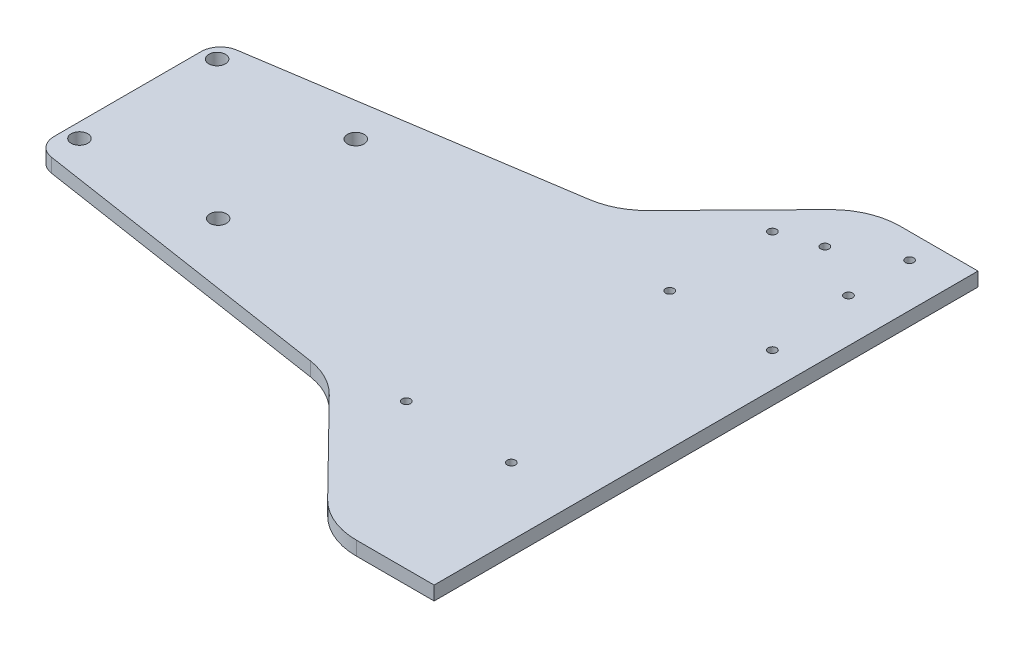
ISO-10303-21;
HEADER;
FILE_DESCRIPTION(('STEP AP214'),'2;1');
FILE_NAME('part.step','',(''),(''),'','','');
FILE_SCHEMA(('AUTOMOTIVE_DESIGN { 1 0 10303 214 1 1 1 1 }'));
ENDSEC;
DATA;
#1=APPLICATION_CONTEXT('core data for automotive mechanical design processes');
#2=APPLICATION_PROTOCOL_DEFINITION('international standard','automotive_design',2000,#1);
#3=PRODUCT_CONTEXT('',#1,'mechanical');
#4=PRODUCT('Part','Part','',(#3));
#5=PRODUCT_RELATED_PRODUCT_CATEGORY('part','',(#4));
#6=PRODUCT_DEFINITION_FORMATION('','',#4);
#7=PRODUCT_DEFINITION_CONTEXT('part definition',#1,'design');
#8=PRODUCT_DEFINITION('design','',#6,#7);
#9=PRODUCT_DEFINITION_SHAPE('','',#8);
#10=(LENGTH_UNIT() NAMED_UNIT(*) SI_UNIT(.MILLI.,.METRE.));
#11=(NAMED_UNIT(*) PLANE_ANGLE_UNIT() SI_UNIT($,.RADIAN.));
#12=(NAMED_UNIT(*) SI_UNIT($,.STERADIAN.) SOLID_ANGLE_UNIT());
#13=UNCERTAINTY_MEASURE_WITH_UNIT(LENGTH_MEASURE(1.E-05),#10,'distance_accuracy_value','');
#14=(GEOMETRIC_REPRESENTATION_CONTEXT(3) GLOBAL_UNCERTAINTY_ASSIGNED_CONTEXT((#13)) GLOBAL_UNIT_ASSIGNED_CONTEXT((#10,
#11,#12)) REPRESENTATION_CONTEXT('',''));
#15=CARTESIAN_POINT('',(0.,0.,0.));
#16=DIRECTION('',(0.,0.,1.));
#17=DIRECTION('',(1.,0.,0.));
#18=AXIS2_PLACEMENT_3D('',#15,#16,#17);
#19=CARTESIAN_POINT('',(200.,5.,-98.));
#20=DIRECTION('',(0.,0.,1.));
#21=DIRECTION('',(1.,0.,0.));
#22=AXIS2_PLACEMENT_3D('',#19,#20,#21);
#23=PLANE('',#22);
#24=DIRECTION('',(-1.,0.,0.));
#25=VECTOR('',#24,1.);
#26=CARTESIAN_POINT('',(200.,0.,-98.));
#27=LINE('',#26,#25);
#28=CARTESIAN_POINT('',(200.,0.,-98.));
#29=VERTEX_POINT('',#28);
#30=CARTESIAN_POINT('',(180.486918987026,0.,-98.));
#31=VERTEX_POINT('',#30);
#32=EDGE_CURVE('E228',#29,#31,#27,.T.);
#33=ORIENTED_EDGE('',*,*,#32,.T.);
#34=DIRECTION('',(0.,-1.,0.));
#35=VECTOR('',#34,1.);
#36=CARTESIAN_POINT('',(180.486918987026,5.,-98.));
#37=LINE('',#36,#35);
#38=CARTESIAN_POINT('',(180.486918987026,5.,-98.));
#39=VERTEX_POINT('',#38);
#40=EDGE_CURVE('E295',#39,#31,#37,.T.);
#41=ORIENTED_EDGE('',*,*,#40,.F.);
#42=DIRECTION('',(-1.,0.,0.));
#43=VECTOR('',#42,1.);
#44=CARTESIAN_POINT('',(200.,5.,-98.));
#45=LINE('',#44,#43);
#46=CARTESIAN_POINT('',(200.,5.,-98.));
#47=VERTEX_POINT('',#46);
#48=EDGE_CURVE('E231',#47,#39,#45,.T.);
#49=ORIENTED_EDGE('',*,*,#48,.F.);
#50=DIRECTION('',(0.,-1.,0.));
#51=VECTOR('',#50,1.);
#52=CARTESIAN_POINT('',(200.,5.,-98.));
#53=LINE('',#52,#51);
#54=EDGE_CURVE('E156',#47,#29,#53,.T.);
#55=ORIENTED_EDGE('',*,*,#54,.T.);
#56=EDGE_LOOP('',(#33,#41,#49,#55));
#57=FACE_BOUND('',#56,.T.);
#58=ADVANCED_FACE('F33',(#57),#23,.F.);
#59=CARTESIAN_POINT('',(180.486918987026,5.,-73.));
#60=DIRECTION('',(0.,-1.,0.));
#61=DIRECTION('',(0.,0.,-1.));
#62=AXIS2_PLACEMENT_3D('',#59,#60,#61);
#63=CYLINDRICAL_SURFACE('',#62,25.);
#64=CARTESIAN_POINT('',(180.486918987026,0.,-73.));
#65=DIRECTION('',(0.,1.,0.));
#66=DIRECTION('',(0.,0.,1.));
#67=AXIS2_PLACEMENT_3D('',#64,#65,#66);
#68=CIRCLE('',#67,25.);
#69=CARTESIAN_POINT('',(162.651427502353,0.,-90.5184258282579));
#70=VERTEX_POINT('',#69);
#71=EDGE_CURVE('E256',#31,#70,#68,.T.);
#72=ORIENTED_EDGE('',*,*,#71,.T.);
#73=DIRECTION('',(0.,-1.,0.));
#74=VECTOR('',#73,1.);
#75=CARTESIAN_POINT('',(162.651427502353,5.,-90.5184258282579));
#76=LINE('',#75,#74);
#77=CARTESIAN_POINT('',(162.651427502353,5.,-90.5184258282579));
#78=VERTEX_POINT('',#77);
#79=EDGE_CURVE('E292',#78,#70,#76,.T.);
#80=ORIENTED_EDGE('',*,*,#79,.F.);
#81=CARTESIAN_POINT('',(180.486918987026,5.,-73.));
#82=DIRECTION('',(0.,1.,0.));
#83=DIRECTION('',(0.,0.,1.));
#84=AXIS2_PLACEMENT_3D('',#81,#82,#83);
#85=CIRCLE('',#84,25.);
#86=EDGE_CURVE('E233',#39,#78,#85,.T.);
#87=ORIENTED_EDGE('',*,*,#86,.F.);
#88=ORIENTED_EDGE('',*,*,#40,.T.);
#89=EDGE_LOOP('',(#72,#80,#87,#88));
#90=FACE_BOUND('',#89,.T.);
#91=ADVANCED_FACE('F389',(#90),#63,.T.);
#92=CARTESIAN_POINT('',(162.651427502353,5.,-90.5184258282579));
#93=DIRECTION('',(0.713419659386898,0.,0.700737033130319));
#94=DIRECTION('',(0.700737033130319,0.,-0.713419659386898));
#95=AXIS2_PLACEMENT_3D('',#92,#93,#94);
#96=PLANE('',#95);
#97=DIRECTION('',(-0.700737033130319,0.,0.713419659386898));
#98=VECTOR('',#97,1.);
#99=CARTESIAN_POINT('',(162.651427502353,0.,-90.5184258282579));
#100=LINE('',#99,#98);
#101=CARTESIAN_POINT('',(130.227508241499,0.,-57.5076666683875));
#102=VERTEX_POINT('',#101);
#103=EDGE_CURVE('E258',#70,#102,#100,.T.);
#104=ORIENTED_EDGE('',*,*,#103,.T.);
#105=DIRECTION('',(0.,-1.,0.));
#106=VECTOR('',#105,1.);
#107=CARTESIAN_POINT('',(130.227508241499,5.,-57.5076666683875));
#108=LINE('',#107,#106);
#109=CARTESIAN_POINT('',(130.227508241499,5.,-57.5076666683875));
#110=VERTEX_POINT('',#109);
#111=EDGE_CURVE('E289',#110,#102,#108,.T.);
#112=ORIENTED_EDGE('',*,*,#111,.F.);
#113=DIRECTION('',(-0.700737033130319,0.,0.713419659386898));
#114=VECTOR('',#113,1.);
#115=CARTESIAN_POINT('',(162.651427502353,5.,-90.5184258282579));
#116=LINE('',#115,#114);
#117=EDGE_CURVE('E236',#78,#110,#116,.T.);
#118=ORIENTED_EDGE('',*,*,#117,.F.);
#119=ORIENTED_EDGE('',*,*,#79,.T.);
#120=EDGE_LOOP('',(#104,#112,#118,#119));
#121=FACE_BOUND('',#120,.T.);
#122=ADVANCED_FACE('F394',(#121),#96,.F.);
#123=CARTESIAN_POINT('',(112.392016756826,5.,-75.0260924966454));
#124=DIRECTION('',(0.,-1.,0.));
#125=DIRECTION('',(0.,0.,-1.));
#126=AXIS2_PLACEMENT_3D('',#123,#124,#125);
#127=CYLINDRICAL_SURFACE('',#126,25.);
#128=CARTESIAN_POINT('',(112.392016756826,0.,-75.0260924966454));
#129=DIRECTION('',(0.,-1.,0.));
#130=DIRECTION('',(0.,0.,1.));
#131=AXIS2_PLACEMENT_3D('',#128,#129,#130);
#132=CIRCLE('',#131,25.);
#133=CARTESIAN_POINT('',(116.181163828613,0.,-50.3149135594038));
#134=VERTEX_POINT('',#133);
#135=EDGE_CURVE('E260',#102,#134,#132,.T.);
#136=ORIENTED_EDGE('',*,*,#135,.T.);
#137=DIRECTION('',(0.,-1.,0.));
#138=VECTOR('',#137,1.);
#139=CARTESIAN_POINT('',(116.181163828613,5.,-50.3149135594038));
#140=LINE('',#139,#138);
#141=CARTESIAN_POINT('',(116.181163828613,5.,-50.3149135594038));
#142=VERTEX_POINT('',#141);
#143=EDGE_CURVE('E286',#142,#134,#140,.T.);
#144=ORIENTED_EDGE('',*,*,#143,.F.);
#145=CARTESIAN_POINT('',(112.392016756826,5.,-75.0260924966454));
#146=DIRECTION('',(0.,-1.,0.));
#147=DIRECTION('',(0.,0.,1.));
#148=AXIS2_PLACEMENT_3D('',#145,#146,#147);
#149=CIRCLE('',#148,25.);
#150=EDGE_CURVE('E238',#110,#142,#149,.T.);
#151=ORIENTED_EDGE('',*,*,#150,.F.);
#152=ORIENTED_EDGE('',*,*,#111,.T.);
#153=EDGE_LOOP('',(#136,#144,#151,#152));
#154=FACE_BOUND('',#153,.T.);
#155=ADVANCED_FACE('F400',(#154),#127,.F.);
#156=CARTESIAN_POINT('',(116.181163828613,5.,-50.3149135594038));
#157=DIRECTION('',(0.151565882871454,0.,0.988447157489664));
#158=DIRECTION('',(0.988447157489664,0.,-0.151565882871454));
#159=AXIS2_PLACEMENT_3D('',#156,#157,#158);
#160=PLANE('',#159);
#161=DIRECTION('',(-0.988447157489664,0.,0.151565882871454));
#162=VECTOR('',#161,1.);
#163=CARTESIAN_POINT('',(116.181163828613,0.,-50.3149135594038));
#164=LINE('',#163,#162);
#165=CARTESIAN_POINT('',(5.93903881989982,0.,-33.4106765650802));
#166=VERTEX_POINT('',#165);
#167=EDGE_CURVE('E262',#134,#166,#164,.T.);
#168=ORIENTED_EDGE('',*,*,#167,.T.);
#169=DIRECTION('',(0.,-1.,0.));
#170=VECTOR('',#169,1.);
#171=CARTESIAN_POINT('',(5.93903881989984,5.,-33.4106765650802));
#172=LINE('',#171,#170);
#173=CARTESIAN_POINT('',(5.93903881989982,5.,-33.4106765650802));
#174=VERTEX_POINT('',#173);
#175=EDGE_CURVE('E11',#166,#174,#172,.F.);
#176=ORIENTED_EDGE('',*,*,#175,.T.);
#177=DIRECTION('',(-0.988447157489664,0.,0.151565882871454));
#178=VECTOR('',#177,1.);
#179=CARTESIAN_POINT('',(116.181163828613,5.,-50.3149135594038));
#180=LINE('',#179,#178);
#181=EDGE_CURVE('E240',#142,#174,#180,.T.);
#182=ORIENTED_EDGE('',*,*,#181,.F.);
#183=ORIENTED_EDGE('',*,*,#143,.T.);
#184=EDGE_LOOP('',(#168,#176,#182,#183));
#185=FACE_BOUND('',#184,.T.);
#186=ADVANCED_FACE('F404',(#185),#160,.F.);
#187=CARTESIAN_POINT('',(0.,5.,19.6247424199696));
#188=DIRECTION('',(1.,0.,0.));
#189=DIRECTION('',(0.,0.,-1.));
#190=AXIS2_PLACEMENT_3D('',#187,#188,#189);
#191=PLANE('',#190);
#192=DIRECTION('',(0.,0.,1.));
#193=VECTOR('',#192,1.);
#194=CARTESIAN_POINT('',(0.,0.,19.6247424199696));
#195=LINE('',#194,#193);
#196=CARTESIAN_POINT('',(0.,0.,-26.4915464626525));
#197=VERTEX_POINT('',#196);
#198=CARTESIAN_POINT('',(0.,0.,26.4915464626525));
#199=VERTEX_POINT('',#198);
#200=EDGE_CURVE('E264',#197,#199,#195,.T.);
#201=ORIENTED_EDGE('',*,*,#200,.T.);
#202=DIRECTION('',(0.,-1.,0.));
#203=VECTOR('',#202,1.);
#204=CARTESIAN_POINT('',(0.,5.,26.4915464626525));
#205=LINE('',#204,#203);
#206=CARTESIAN_POINT('',(0.,5.,26.4915464626525));
#207=VERTEX_POINT('',#206);
#208=EDGE_CURVE('E56',#199,#207,#205,.F.);
#209=ORIENTED_EDGE('',*,*,#208,.T.);
#210=DIRECTION('',(0.,0.,1.));
#211=VECTOR('',#210,1.);
#212=CARTESIAN_POINT('',(0.,5.,-32.5));
#213=LINE('',#212,#211);
#214=CARTESIAN_POINT('',(0.,5.,-26.4915464626525));
#215=VERTEX_POINT('',#214);
#216=EDGE_CURVE('E242',#215,#207,#213,.T.);
#217=ORIENTED_EDGE('',*,*,#216,.F.);
#218=DIRECTION('',(0.,-1.,0.));
#219=VECTOR('',#218,1.);
#220=CARTESIAN_POINT('',(0.,5.,-26.4915464626525));
#221=LINE('',#220,#219);
#222=EDGE_CURVE('E306',#215,#197,#221,.T.);
#223=ORIENTED_EDGE('',*,*,#222,.T.);
#224=EDGE_LOOP('',(#201,#209,#217,#223));
#225=FACE_BOUND('',#224,.T.);
#226=ADVANCED_FACE('F408',(#225),#191,.F.);
#227=CARTESIAN_POINT('',(116.181163828613,5.,50.3149135594038));
#228=DIRECTION('',(0.151565882871454,0.,-0.988447157489664));
#229=DIRECTION('',(-0.988447157489664,0.,-0.151565882871454));
#230=AXIS2_PLACEMENT_3D('',#227,#228,#229);
#231=PLANE('',#230);
#232=DIRECTION('',(0.988447157489664,0.,0.151565882871454));
#233=VECTOR('',#232,1.);
#234=CARTESIAN_POINT('',(116.181163828613,5.,50.3149135594038));
#235=LINE('',#234,#233);
#236=CARTESIAN_POINT('',(5.93903881989982,5.,33.4106765650802));
#237=VERTEX_POINT('',#236);
#238=CARTESIAN_POINT('',(116.181163828613,5.,50.3149135594038));
#239=VERTEX_POINT('',#238);
#240=EDGE_CURVE('E244',#237,#239,#235,.T.);
#241=ORIENTED_EDGE('',*,*,#240,.F.);
#242=DIRECTION('',(0.,-1.,0.));
#243=VECTOR('',#242,1.);
#244=CARTESIAN_POINT('',(5.93903881989984,5.,33.4106765650802));
#245=LINE('',#244,#243);
#246=CARTESIAN_POINT('',(5.93903881989982,0.,33.4106765650802));
#247=VERTEX_POINT('',#246);
#248=EDGE_CURVE('E299',#237,#247,#245,.T.);
#249=ORIENTED_EDGE('',*,*,#248,.T.);
#250=DIRECTION('',(0.988447157489664,0.,0.151565882871454));
#251=VECTOR('',#250,1.);
#252=CARTESIAN_POINT('',(116.181163828613,0.,50.3149135594038));
#253=LINE('',#252,#251);
#254=CARTESIAN_POINT('',(116.181163828613,0.,50.3149135594038));
#255=VERTEX_POINT('',#254);
#256=EDGE_CURVE('E266',#247,#255,#253,.T.);
#257=ORIENTED_EDGE('',*,*,#256,.T.);
#258=DIRECTION('',(0.,-1.,0.));
#259=VECTOR('',#258,1.);
#260=CARTESIAN_POINT('',(116.181163828613,5.,50.3149135594038));
#261=LINE('',#260,#259);
#262=EDGE_CURVE('E283',#239,#255,#261,.T.);
#263=ORIENTED_EDGE('',*,*,#262,.F.);
#264=EDGE_LOOP('',(#241,#249,#257,#263));
#265=FACE_BOUND('',#264,.T.);
#266=ADVANCED_FACE('F370',(#265),#231,.F.);
#267=CARTESIAN_POINT('',(112.392016756826,5.,75.0260924966454));
#268=DIRECTION('',(0.,-1.,0.));
#269=DIRECTION('',(0.,0.,-1.));
#270=AXIS2_PLACEMENT_3D('',#267,#268,#269);
#271=CYLINDRICAL_SURFACE('',#270,25.);
#272=CARTESIAN_POINT('',(112.392016756826,0.,75.0260924966454));
#273=DIRECTION('',(0.,-1.,0.));
#274=DIRECTION('',(0.,0.,-1.));
#275=AXIS2_PLACEMENT_3D('',#272,#273,#274);
#276=CIRCLE('',#275,25.);
#277=CARTESIAN_POINT('',(130.227508241499,0.,57.5076666683875));
#278=VERTEX_POINT('',#277);
#279=EDGE_CURVE('E268',#255,#278,#276,.T.);
#280=ORIENTED_EDGE('',*,*,#279,.T.);
#281=DIRECTION('',(0.,-1.,0.));
#282=VECTOR('',#281,1.);
#283=CARTESIAN_POINT('',(130.227508241499,5.,57.5076666683875));
#284=LINE('',#283,#282);
#285=CARTESIAN_POINT('',(130.227508241499,5.,57.5076666683875));
#286=VERTEX_POINT('',#285);
#287=EDGE_CURVE('E280',#286,#278,#284,.T.);
#288=ORIENTED_EDGE('',*,*,#287,.F.);
#289=CARTESIAN_POINT('',(112.392016756826,5.,75.0260924966454));
#290=DIRECTION('',(0.,-1.,0.));
#291=DIRECTION('',(0.,0.,-1.));
#292=AXIS2_PLACEMENT_3D('',#289,#290,#291);
#293=CIRCLE('',#292,25.);
#294=EDGE_CURVE('E246',#239,#286,#293,.T.);
#295=ORIENTED_EDGE('',*,*,#294,.F.);
#296=ORIENTED_EDGE('',*,*,#262,.T.);
#297=EDGE_LOOP('',(#280,#288,#295,#296));
#298=FACE_BOUND('',#297,.T.);
#299=ADVANCED_FACE('F374',(#298),#271,.F.);
#300=CARTESIAN_POINT('',(162.651427502353,5.,90.5184258282579));
#301=DIRECTION('',(0.713419659386898,0.,-0.700737033130319));
#302=DIRECTION('',(-0.700737033130319,0.,-0.713419659386898));
#303=AXIS2_PLACEMENT_3D('',#300,#301,#302);
#304=PLANE('',#303);
#305=DIRECTION('',(0.700737033130319,0.,0.713419659386898));
#306=VECTOR('',#305,1.);
#307=CARTESIAN_POINT('',(162.651427502353,0.,90.5184258282579));
#308=LINE('',#307,#306);
#309=CARTESIAN_POINT('',(162.651427502353,0.,90.5184258282579));
#310=VERTEX_POINT('',#309);
#311=EDGE_CURVE('E270',#278,#310,#308,.T.);
#312=ORIENTED_EDGE('',*,*,#311,.T.);
#313=DIRECTION('',(0.,-1.,0.));
#314=VECTOR('',#313,1.);
#315=CARTESIAN_POINT('',(162.651427502353,5.,90.5184258282579));
#316=LINE('',#315,#314);
#317=CARTESIAN_POINT('',(162.651427502353,5.,90.5184258282579));
#318=VERTEX_POINT('',#317);
#319=EDGE_CURVE('E277',#318,#310,#316,.T.);
#320=ORIENTED_EDGE('',*,*,#319,.F.);
#321=DIRECTION('',(0.700737033130319,0.,0.713419659386898));
#322=VECTOR('',#321,1.);
#323=CARTESIAN_POINT('',(162.651427502353,5.,90.5184258282579));
#324=LINE('',#323,#322);
#325=EDGE_CURVE('E248',#286,#318,#324,.T.);
#326=ORIENTED_EDGE('',*,*,#325,.F.);
#327=ORIENTED_EDGE('',*,*,#287,.T.);
#328=EDGE_LOOP('',(#312,#320,#326,#327));
#329=FACE_BOUND('',#328,.T.);
#330=ADVANCED_FACE('F415',(#329),#304,.F.);
#331=CARTESIAN_POINT('',(180.486918987026,5.,73.));
#332=DIRECTION('',(0.,-1.,0.));
#333=DIRECTION('',(0.,0.,-1.));
#334=AXIS2_PLACEMENT_3D('',#331,#332,#333);
#335=CYLINDRICAL_SURFACE('',#334,25.);
#336=CARTESIAN_POINT('',(180.486918987026,0.,73.));
#337=DIRECTION('',(0.,1.,0.));
#338=DIRECTION('',(0.,0.,-1.));
#339=AXIS2_PLACEMENT_3D('',#336,#337,#338);
#340=CIRCLE('',#339,25.);
#341=CARTESIAN_POINT('',(180.486918987026,0.,98.));
#342=VERTEX_POINT('',#341);
#343=EDGE_CURVE('E272',#310,#342,#340,.T.);
#344=ORIENTED_EDGE('',*,*,#343,.T.);
#345=DIRECTION('',(0.,-1.,0.));
#346=VECTOR('',#345,1.);
#347=CARTESIAN_POINT('',(180.486918987026,5.,98.));
#348=LINE('',#347,#346);
#349=CARTESIAN_POINT('',(180.486918987026,5.,98.));
#350=VERTEX_POINT('',#349);
#351=EDGE_CURVE('E254',#350,#342,#348,.T.);
#352=ORIENTED_EDGE('',*,*,#351,.F.);
#353=CARTESIAN_POINT('',(180.486918987026,5.,73.));
#354=DIRECTION('',(0.,1.,0.));
#355=DIRECTION('',(0.,0.,-1.));
#356=AXIS2_PLACEMENT_3D('',#353,#354,#355);
#357=CIRCLE('',#356,25.);
#358=EDGE_CURVE('E250',#318,#350,#357,.T.);
#359=ORIENTED_EDGE('',*,*,#358,.F.);
#360=ORIENTED_EDGE('',*,*,#319,.T.);
#361=EDGE_LOOP('',(#344,#352,#359,#360));
#362=FACE_BOUND('',#361,.T.);
#363=ADVANCED_FACE('F418',(#362),#335,.T.);
#364=CARTESIAN_POINT('',(200.,5.,98.));
#365=DIRECTION('',(0.,0.,-1.));
#366=DIRECTION('',(-1.,0.,0.));
#367=AXIS2_PLACEMENT_3D('',#364,#365,#366);
#368=PLANE('',#367);
#369=DIRECTION('',(1.,0.,0.));
#370=VECTOR('',#369,1.);
#371=CARTESIAN_POINT('',(200.,0.,98.));
#372=LINE('',#371,#370);
#373=CARTESIAN_POINT('',(208.513232075427,0.,98.));
#374=VERTEX_POINT('',#373);
#375=EDGE_CURVE('E234',#342,#374,#372,.T.);
#376=ORIENTED_EDGE('',*,*,#375,.T.);
#377=DIRECTION('',(0.,-1.,0.));
#378=VECTOR('',#377,1.);
#379=CARTESIAN_POINT('',(208.513232075427,5.,98.));
#380=LINE('',#379,#378);
#381=CARTESIAN_POINT('',(208.513232075427,5.,98.));
#382=VERTEX_POINT('',#381);
#383=EDGE_CURVE('E183',#382,#374,#380,.T.);
#384=ORIENTED_EDGE('',*,*,#383,.F.);
#385=DIRECTION('',(1.,0.,0.));
#386=VECTOR('',#385,1.);
#387=CARTESIAN_POINT('',(200.,5.,98.));
#388=LINE('',#387,#386);
#389=EDGE_CURVE('E252',#350,#382,#388,.T.);
#390=ORIENTED_EDGE('',*,*,#389,.F.);
#391=ORIENTED_EDGE('',*,*,#351,.T.);
#392=EDGE_LOOP('',(#376,#384,#390,#391));
#393=FACE_BOUND('',#392,.T.);
#394=ADVANCED_FACE('F422',(#393),#368,.F.);
#395=CARTESIAN_POINT('',(180.486918987026,5.,73.));
#396=DIRECTION('',(0.,-1.,0.));
#397=DIRECTION('',(0.,0.,-1.));
#398=AXIS2_PLACEMENT_3D('',#395,#396,#397);
#399=PLANE('',#398);
#400=CARTESIAN_POINT('',(192.80126811493,5.,-89.0722157843655));
#401=DIRECTION('',(0.,1.,0.));
#402=DIRECTION('',(0.,0.,1.));
#403=AXIS2_PLACEMENT_3D('',#400,#401,#402);
#404=CIRCLE('',#403,1.49670718340264);
#405=CARTESIAN_POINT('',(192.80126811493,5.,-87.5755086009629));
#406=VERTEX_POINT('',#405);
#407=EDGE_CURVE('E327',#406,#406,#404,.T.);
#408=ORIENTED_EDGE('',*,*,#407,.F.);
#409=EDGE_LOOP('',(#408));
#410=FACE_BOUND('',#409,.T.);
#411=CARTESIAN_POINT('',(173.269117950926,5.,-78.0588424300018));
#412=DIRECTION('',(0.,1.,0.));
#413=DIRECTION('',(0.,0.,1.));
#414=AXIS2_PLACEMENT_3D('',#411,#412,#413);
#415=CIRCLE('',#414,1.50175207984994);
#416=CARTESIAN_POINT('',(173.269117950926,5.,-76.5570903501519));
#417=VERTEX_POINT('',#416);
#418=EDGE_CURVE('E674',#417,#417,#415,.T.);
#419=ORIENTED_EDGE('',*,*,#418,.F.);
#420=EDGE_LOOP('',(#419));
#421=FACE_BOUND('',#420,.T.);
#422=CARTESIAN_POINT('',(192.80126811493,5.,-67.0454690756381));
#423=DIRECTION('',(0.,1.,0.));
#424=DIRECTION('',(0.,0.,1.));
#425=AXIS2_PLACEMENT_3D('',#422,#423,#424);
#426=CIRCLE('',#425,1.50033955097434);
#427=CARTESIAN_POINT('',(192.80126811493,5.,-65.5451295246637));
#428=VERTEX_POINT('',#427);
#429=EDGE_CURVE('E676',#428,#428,#426,.T.);
#430=ORIENTED_EDGE('',*,*,#429,.F.);
#431=EDGE_LOOP('',(#430));
#432=FACE_BOUND('',#431,.T.);
#433=CARTESIAN_POINT('',(184.199116651955,5.,45.8697624238544));
#434=DIRECTION('',(0.,1.,0.));
#435=DIRECTION('',(0.,0.,1.));
#436=AXIS2_PLACEMENT_3D('',#433,#434,#435);
#437=CIRCLE('',#436,1.5);
#438=CARTESIAN_POINT('',(184.199116651955,5.,47.3697624238544));
#439=VERTEX_POINT('',#438);
#440=EDGE_CURVE('E188',#439,#439,#437,.T.);
#441=ORIENTED_EDGE('',*,*,#440,.F.);
#442=EDGE_LOOP('',(#441));
#443=FACE_BOUND('',#442,.T.);
#444=CARTESIAN_POINT('',(146.150097664698,5.,45.6605184543861));
#445=DIRECTION('',(0.,1.,0.));
#446=DIRECTION('',(0.,0.,1.));
#447=AXIS2_PLACEMENT_3D('',#444,#445,#446);
#448=CIRCLE('',#447,1.5);
#449=CARTESIAN_POINT('',(146.150097664698,5.,47.1605184543861));
#450=VERTEX_POINT('',#449);
#451=EDGE_CURVE('E186',#450,#450,#448,.T.);
#452=ORIENTED_EDGE('',*,*,#451,.F.);
#453=EDGE_LOOP('',(#452));
#454=FACE_BOUND('',#453,.T.);
#455=CARTESIAN_POINT('',(196.148923390512,5.,-36.2745744637224));
#456=DIRECTION('',(0.,1.,0.));
#457=DIRECTION('',(0.,0.,1.));
#458=AXIS2_PLACEMENT_3D('',#455,#456,#457);
#459=CIRCLE('',#458,1.5);
#460=CARTESIAN_POINT('',(196.148923390512,5.,-34.7745744637224));
#461=VERTEX_POINT('',#460);
#462=EDGE_CURVE('E194',#461,#461,#459,.T.);
#463=ORIENTED_EDGE('',*,*,#462,.F.);
#464=EDGE_LOOP('',(#463));
#465=FACE_BOUND('',#464,.T.);
#466=CARTESIAN_POINT('',(159.148923390512,5.,-73.2745744637224));
#467=DIRECTION('',(0.,1.,0.));
#468=DIRECTION('',(0.,0.,1.));
#469=AXIS2_PLACEMENT_3D('',#466,#467,#468);
#470=CIRCLE('',#469,1.5);
#471=CARTESIAN_POINT('',(159.148923390512,5.,-71.7745744637224));
#472=VERTEX_POINT('',#471);
#473=EDGE_CURVE('E198',#472,#472,#470,.T.);
#474=ORIENTED_EDGE('',*,*,#473,.F.);
#475=EDGE_LOOP('',(#474));
#476=FACE_BOUND('',#475,.T.);
#477=CARTESIAN_POINT('',(159.148923390512,5.,-36.2745744637224));
#478=DIRECTION('',(0.,1.,0.));
#479=DIRECTION('',(0.,0.,1.));
#480=AXIS2_PLACEMENT_3D('',#477,#478,#479);
#481=CIRCLE('',#480,1.5);
#482=CARTESIAN_POINT('',(159.148923390512,5.,-34.7745744637224));
#483=VERTEX_POINT('',#482);
#484=EDGE_CURVE('E201',#483,#483,#481,.T.);
#485=ORIENTED_EDGE('',*,*,#484,.F.);
#486=EDGE_LOOP('',(#485));
#487=FACE_BOUND('',#486,.T.);
#488=CARTESIAN_POINT('',(5.2281324288205,5.,-27.0587926902217));
#489=DIRECTION('',(0.,1.,0.));
#490=DIRECTION('',(0.,0.,1.));
#491=AXIS2_PLACEMENT_3D('',#488,#489,#490);
#492=CIRCLE('',#491,3.);
#493=CARTESIAN_POINT('',(5.2281324288205,5.,-24.0587926902217));
#494=VERTEX_POINT('',#493);
#495=EDGE_CURVE('E217',#494,#494,#492,.T.);
#496=ORIENTED_EDGE('',*,*,#495,.F.);
#497=EDGE_LOOP('',(#496));
#498=FACE_BOUND('',#497,.T.);
#499=CARTESIAN_POINT('',(55.2084296904433,5.,22.5420852748644));
#500=DIRECTION('',(0.,1.,0.));
#501=DIRECTION('',(0.,0.,1.));
#502=AXIS2_PLACEMENT_3D('',#499,#500,#501);
#503=CIRCLE('',#502,3.);
#504=CARTESIAN_POINT('',(55.2084296904433,5.,25.5420852748644));
#505=VERTEX_POINT('',#504);
#506=EDGE_CURVE('E208',#505,#505,#503,.T.);
#507=ORIENTED_EDGE('',*,*,#506,.F.);
#508=EDGE_LOOP('',(#507));
#509=FACE_BOUND('',#508,.T.);
#510=CARTESIAN_POINT('',(55.2084296904433,5.,-27.0587926902217));
#511=DIRECTION('',(0.,1.,0.));
#512=DIRECTION('',(0.,0.,1.));
#513=AXIS2_PLACEMENT_3D('',#510,#511,#512);
#514=CIRCLE('',#513,3.);
#515=CARTESIAN_POINT('',(55.2084296904433,5.,-24.0587926902217));
#516=VERTEX_POINT('',#515);
#517=EDGE_CURVE('E209',#516,#516,#514,.T.);
#518=ORIENTED_EDGE('',*,*,#517,.F.);
#519=EDGE_LOOP('',(#518));
#520=FACE_BOUND('',#519,.T.);
#521=CARTESIAN_POINT('',(5.22813242882052,5.,22.5420852748644));
#522=DIRECTION('',(0.,1.,0.));
#523=DIRECTION('',(0.,0.,1.));
#524=AXIS2_PLACEMENT_3D('',#521,#522,#523);
#525=CIRCLE('',#524,3.);
#526=CARTESIAN_POINT('',(5.22813242882052,5.,25.5420852748644));
#527=VERTEX_POINT('',#526);
#528=EDGE_CURVE('E216',#527,#527,#525,.T.);
#529=ORIENTED_EDGE('',*,*,#528,.F.);
#530=EDGE_LOOP('',(#529));
#531=FACE_BOUND('',#530,.T.);
#532=ORIENTED_EDGE('',*,*,#216,.T.);
#533=CARTESIAN_POINT('',(7.00000000000001,5.,26.4915464626525));
#534=DIRECTION('',(0.,-1.,0.));
#535=DIRECTION('',(0.,0.,-1.));
#536=AXIS2_PLACEMENT_3D('',#533,#534,#535);
#537=CIRCLE('',#536,7.);
#538=EDGE_CURVE('E42',#207,#237,#537,.F.);
#539=ORIENTED_EDGE('',*,*,#538,.T.);
#540=ORIENTED_EDGE('',*,*,#240,.T.);
#541=ORIENTED_EDGE('',*,*,#294,.T.);
#542=ORIENTED_EDGE('',*,*,#325,.T.);
#543=ORIENTED_EDGE('',*,*,#358,.T.);
#544=ORIENTED_EDGE('',*,*,#389,.T.);
#545=DIRECTION('',(0.,0.,1.));
#546=VECTOR('',#545,1.);
#547=CARTESIAN_POINT('',(208.513232075427,5.,98.));
#548=LINE('',#547,#546);
#549=CARTESIAN_POINT('',(208.513232075427,5.,-98.0230823498643));
#550=VERTEX_POINT('',#549);
#551=EDGE_CURVE('E169',#550,#382,#548,.T.);
#552=ORIENTED_EDGE('',*,*,#551,.F.);
#553=DIRECTION('',(1.,0.,0.));
#554=VECTOR('',#553,1.);
#555=CARTESIAN_POINT('',(200.,5.,-98.0230823498643));
#556=LINE('',#555,#554);
#557=CARTESIAN_POINT('',(200.,5.,-98.0230823498643));
#558=VERTEX_POINT('',#557);
#559=EDGE_CURVE('E160',#558,#550,#556,.T.);
#560=ORIENTED_EDGE('',*,*,#559,.F.);
#561=DIRECTION('',(0.,0.,-1.));
#562=VECTOR('',#561,1.);
#563=CARTESIAN_POINT('',(200.,5.,98.));
#564=LINE('',#563,#562);
#565=EDGE_CURVE('E150',#47,#558,#564,.T.);
#566=ORIENTED_EDGE('',*,*,#565,.F.);
#567=ORIENTED_EDGE('',*,*,#48,.T.);
#568=ORIENTED_EDGE('',*,*,#86,.T.);
#569=ORIENTED_EDGE('',*,*,#117,.T.);
#570=ORIENTED_EDGE('',*,*,#150,.T.);
#571=ORIENTED_EDGE('',*,*,#181,.T.);
#572=CARTESIAN_POINT('',(7.,5.,-26.4915464626525));
#573=DIRECTION('',(0.,-1.,0.));
#574=DIRECTION('',(0.,0.,-1.));
#575=AXIS2_PLACEMENT_3D('',#572,#573,#574);
#576=CIRCLE('',#575,7.);
#577=EDGE_CURVE('E310',#174,#215,#576,.F.);
#578=ORIENTED_EDGE('',*,*,#577,.T.);
#579=EDGE_LOOP('',(#532,#539,#540,#541,#542,#543,#544,#552,#560,#566,#567,#568,#569,#570,#571,#578));
#580=FACE_BOUND('',#579,.T.);
#581=ADVANCED_FACE('F172',(#410,#421,#432,#443,#454,#465,#476,#487,#498,#509,#520,#531,#580),
#399,.F.);
#582=CARTESIAN_POINT('',(180.486918987026,0.,73.));
#583=DIRECTION('',(0.,-1.,0.));
#584=DIRECTION('',(0.,0.,-1.));
#585=AXIS2_PLACEMENT_3D('',#582,#583,#584);
#586=PLANE('',#585);
#587=CARTESIAN_POINT('',(192.80126811493,0.,-89.0722157843655));
#588=DIRECTION('',(0.,-1.,0.));
#589=DIRECTION('',(0.,0.,-1.));
#590=AXIS2_PLACEMENT_3D('',#587,#588,#589);
#591=CIRCLE('',#590,1.49670718340264);
#592=CARTESIAN_POINT('',(192.80126811493,0.,-90.5689229677682));
#593=VERTEX_POINT('',#592);
#594=EDGE_CURVE('E37',#593,#593,#591,.T.);
#595=ORIENTED_EDGE('',*,*,#594,.F.);
#596=EDGE_LOOP('',(#595));
#597=FACE_BOUND('',#596,.T.);
#598=CARTESIAN_POINT('',(173.269117950926,0.,-78.0588424300018));
#599=DIRECTION('',(0.,-1.,0.));
#600=DIRECTION('',(0.,0.,-1.));
#601=AXIS2_PLACEMENT_3D('',#598,#599,#600);
#602=CIRCLE('',#601,1.50175207984994);
#603=CARTESIAN_POINT('',(173.269117950926,0.,-79.5605945098517));
#604=VERTEX_POINT('',#603);
#605=EDGE_CURVE('E326',#604,#604,#602,.T.);
#606=ORIENTED_EDGE('',*,*,#605,.F.);
#607=EDGE_LOOP('',(#606));
#608=FACE_BOUND('',#607,.T.);
#609=CARTESIAN_POINT('',(192.80126811493,0.,-67.0454690756381));
#610=DIRECTION('',(0.,-1.,0.));
#611=DIRECTION('',(0.,0.,-1.));
#612=AXIS2_PLACEMENT_3D('',#609,#610,#611);
#613=CIRCLE('',#612,1.50033955097434);
#614=CARTESIAN_POINT('',(192.80126811493,0.,-68.5458086266124));
#615=VERTEX_POINT('',#614);
#616=EDGE_CURVE('E324',#615,#615,#613,.T.);
#617=ORIENTED_EDGE('',*,*,#616,.F.);
#618=EDGE_LOOP('',(#617));
#619=FACE_BOUND('',#618,.T.);
#620=CARTESIAN_POINT('',(184.199116651955,0.,45.8697624238544));
#621=DIRECTION('',(0.,-1.,0.));
#622=DIRECTION('',(0.,0.,-1.));
#623=AXIS2_PLACEMENT_3D('',#620,#621,#622);
#624=CIRCLE('',#623,1.5);
#625=CARTESIAN_POINT('',(184.199116651955,0.,44.3697624238544));
#626=VERTEX_POINT('',#625);
#627=EDGE_CURVE('E204',#626,#626,#624,.T.);
#628=ORIENTED_EDGE('',*,*,#627,.F.);
#629=EDGE_LOOP('',(#628));
#630=FACE_BOUND('',#629,.T.);
#631=CARTESIAN_POINT('',(146.150097664698,0.,45.6605184543861));
#632=DIRECTION('',(0.,-1.,0.));
#633=DIRECTION('',(0.,0.,-1.));
#634=AXIS2_PLACEMENT_3D('',#631,#632,#633);
#635=CIRCLE('',#634,1.5);
#636=CARTESIAN_POINT('',(146.150097664698,0.,44.1605184543862));
#637=VERTEX_POINT('',#636);
#638=EDGE_CURVE('E191',#637,#637,#635,.T.);
#639=ORIENTED_EDGE('',*,*,#638,.F.);
#640=EDGE_LOOP('',(#639));
#641=FACE_BOUND('',#640,.T.);
#642=CARTESIAN_POINT('',(196.148923390512,0.,-36.2745744637224));
#643=DIRECTION('',(0.,-1.,0.));
#644=DIRECTION('',(0.,0.,-1.));
#645=AXIS2_PLACEMENT_3D('',#642,#643,#644);
#646=CIRCLE('',#645,1.5);
#647=CARTESIAN_POINT('',(196.148923390512,0.,-37.7745744637224));
#648=VERTEX_POINT('',#647);
#649=EDGE_CURVE('E212',#648,#648,#646,.T.);
#650=ORIENTED_EDGE('',*,*,#649,.F.);
#651=EDGE_LOOP('',(#650));
#652=FACE_BOUND('',#651,.T.);
#653=CARTESIAN_POINT('',(159.148923390512,0.,-73.2745744637224));
#654=DIRECTION('',(0.,-1.,0.));
#655=DIRECTION('',(0.,0.,-1.));
#656=AXIS2_PLACEMENT_3D('',#653,#654,#655);
#657=CIRCLE('',#656,1.5);
#658=CARTESIAN_POINT('',(159.148923390512,0.,-74.7745744637224));
#659=VERTEX_POINT('',#658);
#660=EDGE_CURVE('E315',#659,#659,#657,.T.);
#661=ORIENTED_EDGE('',*,*,#660,.F.);
#662=EDGE_LOOP('',(#661));
#663=FACE_BOUND('',#662,.T.);
#664=CARTESIAN_POINT('',(159.148923390512,0.,-36.2745744637224));
#665=DIRECTION('',(0.,-1.,0.));
#666=DIRECTION('',(0.,0.,-1.));
#667=AXIS2_PLACEMENT_3D('',#664,#665,#666);
#668=CIRCLE('',#667,1.5);
#669=CARTESIAN_POINT('',(159.148923390512,0.,-37.7745744637224));
#670=VERTEX_POINT('',#669);
#671=EDGE_CURVE('E197',#670,#670,#668,.T.);
#672=ORIENTED_EDGE('',*,*,#671,.F.);
#673=EDGE_LOOP('',(#672));
#674=FACE_BOUND('',#673,.T.);
#675=CARTESIAN_POINT('',(5.2281324288205,0.,-27.0587926902217));
#676=DIRECTION('',(0.,1.,0.));
#677=DIRECTION('',(0.,0.,1.));
#678=AXIS2_PLACEMENT_3D('',#675,#676,#677);
#679=CIRCLE('',#678,3.);
#680=CARTESIAN_POINT('',(5.2281324288205,0.,-24.0587926902217));
#681=VERTEX_POINT('',#680);
#682=EDGE_CURVE('E213',#681,#681,#679,.T.);
#683=ORIENTED_EDGE('',*,*,#682,.T.);
#684=EDGE_LOOP('',(#683));
#685=FACE_BOUND('',#684,.T.);
#686=CARTESIAN_POINT('',(55.2084296904433,0.,22.5420852748644));
#687=DIRECTION('',(0.,1.,0.));
#688=DIRECTION('',(0.,0.,1.));
#689=AXIS2_PLACEMENT_3D('',#686,#687,#688);
#690=CIRCLE('',#689,3.);
#691=CARTESIAN_POINT('',(55.2084296904433,0.,25.5420852748644));
#692=VERTEX_POINT('',#691);
#693=EDGE_CURVE('E220',#692,#692,#690,.T.);
#694=ORIENTED_EDGE('',*,*,#693,.T.);
#695=EDGE_LOOP('',(#694));
#696=FACE_BOUND('',#695,.T.);
#697=CARTESIAN_POINT('',(55.2084296904433,0.,-27.0587926902217));
#698=DIRECTION('',(0.,1.,0.));
#699=DIRECTION('',(0.,0.,1.));
#700=AXIS2_PLACEMENT_3D('',#697,#698,#699);
#701=CIRCLE('',#700,3.);
#702=CARTESIAN_POINT('',(55.2084296904433,0.,-24.0587926902217));
#703=VERTEX_POINT('',#702);
#704=EDGE_CURVE('E205',#703,#703,#701,.T.);
#705=ORIENTED_EDGE('',*,*,#704,.T.);
#706=EDGE_LOOP('',(#705));
#707=FACE_BOUND('',#706,.T.);
#708=CARTESIAN_POINT('',(5.22813242882052,0.,22.5420852748644));
#709=DIRECTION('',(0.,1.,0.));
#710=DIRECTION('',(0.,0.,1.));
#711=AXIS2_PLACEMENT_3D('',#708,#709,#710);
#712=CIRCLE('',#711,3.);
#713=CARTESIAN_POINT('',(5.22813242882052,0.,25.5420852748644));
#714=VERTEX_POINT('',#713);
#715=EDGE_CURVE('E225',#714,#714,#712,.T.);
#716=ORIENTED_EDGE('',*,*,#715,.T.);
#717=EDGE_LOOP('',(#716));
#718=FACE_BOUND('',#717,.T.);
#719=ORIENTED_EDGE('',*,*,#256,.F.);
#720=CARTESIAN_POINT('',(7.00000000000001,0.,26.4915464626525));
#721=DIRECTION('',(0.,-1.,0.));
#722=DIRECTION('',(0.,0.,-1.));
#723=AXIS2_PLACEMENT_3D('',#720,#721,#722);
#724=CIRCLE('',#723,7.);
#725=EDGE_CURVE('E304',#247,#199,#724,.T.);
#726=ORIENTED_EDGE('',*,*,#725,.T.);
#727=ORIENTED_EDGE('',*,*,#200,.F.);
#728=CARTESIAN_POINT('',(7.,0.,-26.4915464626525));
#729=DIRECTION('',(0.,-1.,0.));
#730=DIRECTION('',(0.,0.,-1.));
#731=AXIS2_PLACEMENT_3D('',#728,#729,#730);
#732=CIRCLE('',#731,7.);
#733=EDGE_CURVE('E302',#197,#166,#732,.T.);
#734=ORIENTED_EDGE('',*,*,#733,.T.);
#735=ORIENTED_EDGE('',*,*,#167,.F.);
#736=ORIENTED_EDGE('',*,*,#135,.F.);
#737=ORIENTED_EDGE('',*,*,#103,.F.);
#738=ORIENTED_EDGE('',*,*,#71,.F.);
#739=ORIENTED_EDGE('',*,*,#32,.F.);
#740=DIRECTION('',(0.,0.,-1.));
#741=VECTOR('',#740,1.);
#742=CARTESIAN_POINT('',(200.,0.,98.));
#743=LINE('',#742,#741);
#744=CARTESIAN_POINT('',(200.,0.,-98.0230823498643));
#745=VERTEX_POINT('',#744);
#746=EDGE_CURVE('E178',#29,#745,#743,.T.);
#747=ORIENTED_EDGE('',*,*,#746,.T.);
#748=DIRECTION('',(1.,0.,0.));
#749=VECTOR('',#748,1.);
#750=CARTESIAN_POINT('',(200.,0.,-98.0230823498643));
#751=LINE('',#750,#749);
#752=CARTESIAN_POINT('',(208.513232075427,0.,-98.0230823498643));
#753=VERTEX_POINT('',#752);
#754=EDGE_CURVE('E167',#745,#753,#751,.T.);
#755=ORIENTED_EDGE('',*,*,#754,.T.);
#756=DIRECTION('',(0.,0.,1.));
#757=VECTOR('',#756,1.);
#758=CARTESIAN_POINT('',(208.513232075427,0.,98.));
#759=LINE('',#758,#757);
#760=EDGE_CURVE('E161',#753,#374,#759,.T.);
#761=ORIENTED_EDGE('',*,*,#760,.T.);
#762=ORIENTED_EDGE('',*,*,#375,.F.);
#763=ORIENTED_EDGE('',*,*,#343,.F.);
#764=ORIENTED_EDGE('',*,*,#311,.F.);
#765=ORIENTED_EDGE('',*,*,#279,.F.);
#766=EDGE_LOOP('',(#719,#726,#727,#734,#735,#736,#737,#738,#739,#747,#755,#761,#762,#763,#764,#765));
#767=FACE_BOUND('',#766,.T.);
#768=ADVANCED_FACE('F337',(#597,#608,#619,#630,#641,#652,#663,#674,#685,#696,#707,#718,#767),
#586,.T.);
#769=CARTESIAN_POINT('',(7.00000000000001,5.,26.4915464626525));
#770=DIRECTION('',(0.,-1.,0.));
#771=DIRECTION('',(0.,0.,-1.));
#772=AXIS2_PLACEMENT_3D('',#769,#770,#771);
#773=CYLINDRICAL_SURFACE('',#772,7.);
#774=ORIENTED_EDGE('',*,*,#538,.F.);
#775=ORIENTED_EDGE('',*,*,#208,.F.);
#776=ORIENTED_EDGE('',*,*,#725,.F.);
#777=ORIENTED_EDGE('',*,*,#248,.F.);
#778=EDGE_LOOP('',(#774,#775,#776,#777));
#779=FACE_BOUND('',#778,.T.);
#780=ADVANCED_FACE('F340',(#779),#773,.T.);
#781=CARTESIAN_POINT('',(7.,5.,-26.4915464626525));
#782=DIRECTION('',(0.,-1.,0.));
#783=DIRECTION('',(0.,0.,-1.));
#784=AXIS2_PLACEMENT_3D('',#781,#782,#783);
#785=CYLINDRICAL_SURFACE('',#784,7.);
#786=ORIENTED_EDGE('',*,*,#577,.F.);
#787=ORIENTED_EDGE('',*,*,#175,.F.);
#788=ORIENTED_EDGE('',*,*,#733,.F.);
#789=ORIENTED_EDGE('',*,*,#222,.F.);
#790=EDGE_LOOP('',(#786,#787,#788,#789));
#791=FACE_BOUND('',#790,.T.);
#792=ADVANCED_FACE('F35',(#791),#785,.T.);
#793=CARTESIAN_POINT('',(5.22813242882052,0.,22.5420852748644));
#794=DIRECTION('',(0.,1.,0.));
#795=DIRECTION('',(0.,0.,1.));
#796=AXIS2_PLACEMENT_3D('',#793,#794,#795);
#797=CYLINDRICAL_SURFACE('',#796,3.);
#798=ORIENTED_EDGE('',*,*,#715,.F.);
#799=EDGE_LOOP('',(#798));
#800=FACE_BOUND('',#799,.T.);
#801=ORIENTED_EDGE('',*,*,#528,.T.);
#802=EDGE_LOOP('',(#801));
#803=FACE_BOUND('',#802,.T.);
#804=ADVANCED_FACE('F385',(#800,#803),#797,.F.);
#805=CARTESIAN_POINT('',(55.2084296904433,0.,-27.0587926902217));
#806=DIRECTION('',(0.,1.,0.));
#807=DIRECTION('',(0.,0.,1.));
#808=AXIS2_PLACEMENT_3D('',#805,#806,#807);
#809=CYLINDRICAL_SURFACE('',#808,3.);
#810=ORIENTED_EDGE('',*,*,#704,.F.);
#811=EDGE_LOOP('',(#810));
#812=FACE_BOUND('',#811,.T.);
#813=ORIENTED_EDGE('',*,*,#517,.T.);
#814=EDGE_LOOP('',(#813));
#815=FACE_BOUND('',#814,.T.);
#816=ADVANCED_FACE('F432',(#812,#815),#809,.F.);
#817=CARTESIAN_POINT('',(55.2084296904433,0.,22.5420852748644));
#818=DIRECTION('',(0.,1.,0.));
#819=DIRECTION('',(0.,0.,1.));
#820=AXIS2_PLACEMENT_3D('',#817,#818,#819);
#821=CYLINDRICAL_SURFACE('',#820,3.);
#822=ORIENTED_EDGE('',*,*,#693,.F.);
#823=EDGE_LOOP('',(#822));
#824=FACE_BOUND('',#823,.T.);
#825=ORIENTED_EDGE('',*,*,#506,.T.);
#826=EDGE_LOOP('',(#825));
#827=FACE_BOUND('',#826,.T.);
#828=ADVANCED_FACE('F434',(#824,#827),#821,.F.);
#829=CARTESIAN_POINT('',(5.2281324288205,0.,-27.0587926902217));
#830=DIRECTION('',(0.,1.,0.));
#831=DIRECTION('',(0.,0.,1.));
#832=AXIS2_PLACEMENT_3D('',#829,#830,#831);
#833=CYLINDRICAL_SURFACE('',#832,3.);
#834=ORIENTED_EDGE('',*,*,#682,.F.);
#835=EDGE_LOOP('',(#834));
#836=FACE_BOUND('',#835,.T.);
#837=ORIENTED_EDGE('',*,*,#495,.T.);
#838=EDGE_LOOP('',(#837));
#839=FACE_BOUND('',#838,.T.);
#840=ADVANCED_FACE('F437',(#836,#839),#833,.F.);
#841=CARTESIAN_POINT('',(159.148923390512,-5.,-36.2745744637224));
#842=DIRECTION('',(0.,1.,0.));
#843=DIRECTION('',(0.,0.,1.));
#844=AXIS2_PLACEMENT_3D('',#841,#842,#843);
#845=CYLINDRICAL_SURFACE('',#844,1.5);
#846=ORIENTED_EDGE('',*,*,#671,.T.);
#847=EDGE_LOOP('',(#846));
#848=FACE_BOUND('',#847,.T.);
#849=ORIENTED_EDGE('',*,*,#484,.T.);
#850=EDGE_LOOP('',(#849));
#851=FACE_BOUND('',#850,.T.);
#852=ADVANCED_FACE('F441',(#848,#851),#845,.F.);
#853=CARTESIAN_POINT('',(159.148923390512,-5.,-73.2745744637224));
#854=DIRECTION('',(0.,1.,0.));
#855=DIRECTION('',(0.,0.,1.));
#856=AXIS2_PLACEMENT_3D('',#853,#854,#855);
#857=CYLINDRICAL_SURFACE('',#856,1.5);
#858=ORIENTED_EDGE('',*,*,#660,.T.);
#859=EDGE_LOOP('',(#858));
#860=FACE_BOUND('',#859,.T.);
#861=ORIENTED_EDGE('',*,*,#473,.T.);
#862=EDGE_LOOP('',(#861));
#863=FACE_BOUND('',#862,.T.);
#864=ADVANCED_FACE('F448',(#860,#863),#857,.F.);
#865=CARTESIAN_POINT('',(196.148923390512,-5.,-36.2745744637224));
#866=DIRECTION('',(0.,1.,0.));
#867=DIRECTION('',(0.,0.,1.));
#868=AXIS2_PLACEMENT_3D('',#865,#866,#867);
#869=CYLINDRICAL_SURFACE('',#868,1.5);
#870=ORIENTED_EDGE('',*,*,#649,.T.);
#871=EDGE_LOOP('',(#870));
#872=FACE_BOUND('',#871,.T.);
#873=ORIENTED_EDGE('',*,*,#462,.T.);
#874=EDGE_LOOP('',(#873));
#875=FACE_BOUND('',#874,.T.);
#876=ADVANCED_FACE('F452',(#872,#875),#869,.F.);
#877=CARTESIAN_POINT('',(146.150097664698,-5.,45.6605184543861));
#878=DIRECTION('',(0.,1.,0.));
#879=DIRECTION('',(0.,0.,1.));
#880=AXIS2_PLACEMENT_3D('',#877,#878,#879);
#881=CYLINDRICAL_SURFACE('',#880,1.5);
#882=ORIENTED_EDGE('',*,*,#638,.T.);
#883=EDGE_LOOP('',(#882));
#884=FACE_BOUND('',#883,.T.);
#885=ORIENTED_EDGE('',*,*,#451,.T.);
#886=EDGE_LOOP('',(#885));
#887=FACE_BOUND('',#886,.T.);
#888=ADVANCED_FACE('F456',(#884,#887),#881,.F.);
#889=CARTESIAN_POINT('',(184.199116651955,-5.,45.8697624238544));
#890=DIRECTION('',(0.,1.,0.));
#891=DIRECTION('',(0.,0.,1.));
#892=AXIS2_PLACEMENT_3D('',#889,#890,#891);
#893=CYLINDRICAL_SURFACE('',#892,1.5);
#894=ORIENTED_EDGE('',*,*,#627,.T.);
#895=EDGE_LOOP('',(#894));
#896=FACE_BOUND('',#895,.T.);
#897=ORIENTED_EDGE('',*,*,#440,.T.);
#898=EDGE_LOOP('',(#897));
#899=FACE_BOUND('',#898,.T.);
#900=ADVANCED_FACE('F460',(#896,#899),#893,.F.);
#901=CARTESIAN_POINT('',(200.,5.,98.));
#902=DIRECTION('',(-1.,0.,0.));
#903=DIRECTION('',(0.,0.,1.));
#904=AXIS2_PLACEMENT_3D('',#901,#902,#903);
#905=PLANE('',#904);
#906=ORIENTED_EDGE('',*,*,#54,.F.);
#907=ORIENTED_EDGE('',*,*,#565,.T.);
#908=DIRECTION('',(0.,-1.,0.));
#909=VECTOR('',#908,1.);
#910=CARTESIAN_POINT('',(200.,5.,-98.0230823498643));
#911=LINE('',#910,#909);
#912=EDGE_CURVE('E153',#558,#745,#911,.T.);
#913=ORIENTED_EDGE('',*,*,#912,.T.);
#914=ORIENTED_EDGE('',*,*,#746,.F.);
#915=EDGE_LOOP('',(#906,#907,#913,#914));
#916=FACE_BOUND('',#915,.T.);
#917=ADVANCED_FACE('F152',(#916),#905,.T.);
#918=CARTESIAN_POINT('',(208.513232075427,5.,98.));
#919=DIRECTION('',(1.,0.,0.));
#920=DIRECTION('',(0.,0.,-1.));
#921=AXIS2_PLACEMENT_3D('',#918,#919,#920);
#922=PLANE('',#921);
#923=ORIENTED_EDGE('',*,*,#760,.F.);
#924=DIRECTION('',(0.,-1.,0.));
#925=VECTOR('',#924,1.);
#926=CARTESIAN_POINT('',(208.513232075427,5.,-98.0230823498643));
#927=LINE('',#926,#925);
#928=EDGE_CURVE('E168',#550,#753,#927,.T.);
#929=ORIENTED_EDGE('',*,*,#928,.F.);
#930=ORIENTED_EDGE('',*,*,#551,.T.);
#931=ORIENTED_EDGE('',*,*,#383,.T.);
#932=EDGE_LOOP('',(#923,#929,#930,#931));
#933=FACE_BOUND('',#932,.T.);
#934=ADVANCED_FACE('F467',(#933),#922,.T.);
#935=CARTESIAN_POINT('',(200.,5.,-98.0230823498643));
#936=DIRECTION('',(0.,0.,-1.));
#937=DIRECTION('',(-1.,0.,0.));
#938=AXIS2_PLACEMENT_3D('',#935,#936,#937);
#939=PLANE('',#938);
#940=ORIENTED_EDGE('',*,*,#754,.F.);
#941=ORIENTED_EDGE('',*,*,#912,.F.);
#942=ORIENTED_EDGE('',*,*,#559,.T.);
#943=ORIENTED_EDGE('',*,*,#928,.T.);
#944=EDGE_LOOP('',(#940,#941,#942,#943));
#945=FACE_BOUND('',#944,.T.);
#946=ADVANCED_FACE('F165',(#945),#939,.T.);
#947=CARTESIAN_POINT('',(192.80126811493,-5.,-67.0454690756381));
#948=DIRECTION('',(0.,1.,0.));
#949=DIRECTION('',(0.,0.,1.));
#950=AXIS2_PLACEMENT_3D('',#947,#948,#949);
#951=CYLINDRICAL_SURFACE('',#950,1.50033955097434);
#952=ORIENTED_EDGE('',*,*,#616,.T.);
#953=EDGE_LOOP('',(#952));
#954=FACE_BOUND('',#953,.T.);
#955=ORIENTED_EDGE('',*,*,#429,.T.);
#956=EDGE_LOOP('',(#955));
#957=FACE_BOUND('',#956,.T.);
#958=ADVANCED_FACE('F470',(#954,#957),#951,.F.);
#959=CARTESIAN_POINT('',(173.269117950926,-5.,-78.0588424300018));
#960=DIRECTION('',(0.,1.,0.));
#961=DIRECTION('',(0.,0.,1.));
#962=AXIS2_PLACEMENT_3D('',#959,#960,#961);
#963=CYLINDRICAL_SURFACE('',#962,1.50175207984994);
#964=ORIENTED_EDGE('',*,*,#605,.T.);
#965=EDGE_LOOP('',(#964));
#966=FACE_BOUND('',#965,.T.);
#967=ORIENTED_EDGE('',*,*,#418,.T.);
#968=EDGE_LOOP('',(#967));
#969=FACE_BOUND('',#968,.T.);
#970=ADVANCED_FACE('F476',(#966,#969),#963,.F.);
#971=CARTESIAN_POINT('',(192.80126811493,-5.,-89.0722157843655));
#972=DIRECTION('',(0.,1.,0.));
#973=DIRECTION('',(0.,0.,1.));
#974=AXIS2_PLACEMENT_3D('',#971,#972,#973);
#975=CYLINDRICAL_SURFACE('',#974,1.49670718340264);
#976=ORIENTED_EDGE('',*,*,#594,.T.);
#977=EDGE_LOOP('',(#976));
#978=FACE_BOUND('',#977,.T.);
#979=ORIENTED_EDGE('',*,*,#407,.T.);
#980=EDGE_LOOP('',(#979));
#981=FACE_BOUND('',#980,.T.);
#982=ADVANCED_FACE('F334',(#978,#981),#975,.F.);
#983=CLOSED_SHELL('',(#58,#91,#122,#155,#186,#226,#266,#299,#330,#363,#394,#581,#768,#780,#792,
#804,#816,#828,#840,#852,#864,#876,#888,#900,#917,#934,#946,#958,#970,#982));
#984=MANIFOLD_SOLID_BREP('B2',#983);
#985=ADVANCED_BREP_SHAPE_REPRESENTATION('',(#18,#984),#14);
#986=SHAPE_DEFINITION_REPRESENTATION(#9,#985);
ENDSEC;
END-ISO-10303-21;
